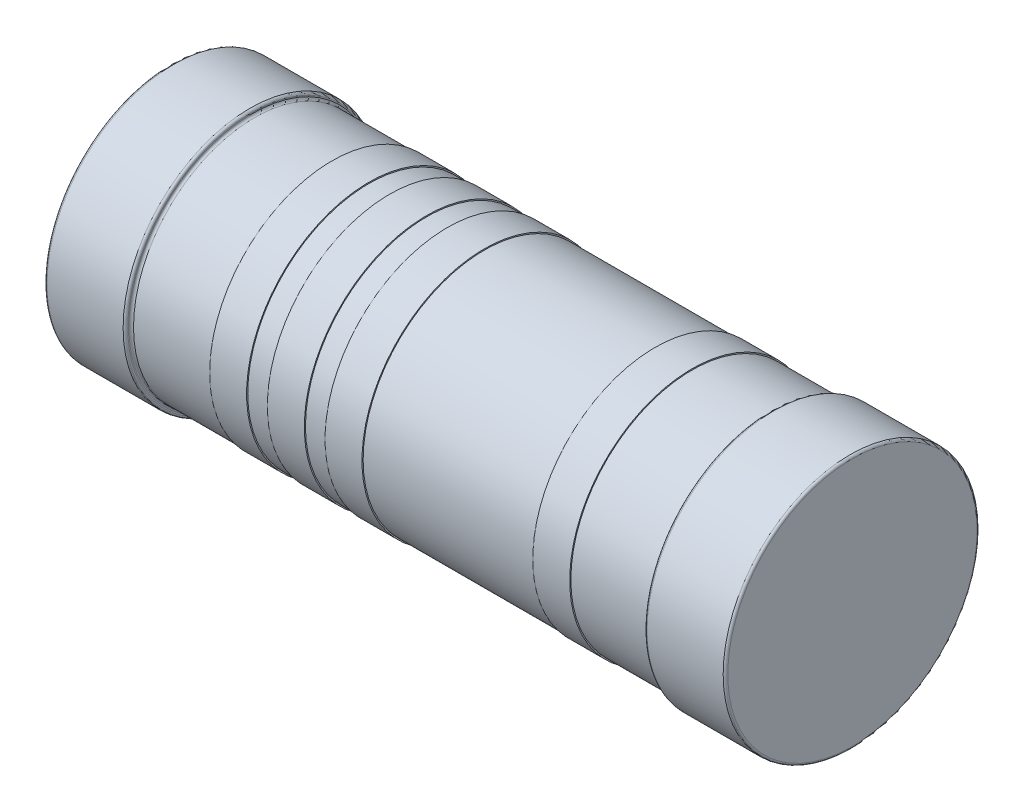
ISO-10303-21;
HEADER;
FILE_DESCRIPTION(('STEP AP214'),'2;1');
FILE_NAME('part.step','',(''),(''),'','','');
FILE_SCHEMA(('AUTOMOTIVE_DESIGN { 1 0 10303 214 1 1 1 1 }'));
ENDSEC;
DATA;
#1=APPLICATION_CONTEXT('core data for automotive mechanical design processes');
#2=APPLICATION_PROTOCOL_DEFINITION('international standard','automotive_design',2000,#1);
#3=PRODUCT_CONTEXT('',#1,'mechanical');
#4=PRODUCT('Part','Part','',(#3));
#5=PRODUCT_RELATED_PRODUCT_CATEGORY('part','',(#4));
#6=PRODUCT_DEFINITION_FORMATION('','',#4);
#7=PRODUCT_DEFINITION_CONTEXT('part definition',#1,'design');
#8=PRODUCT_DEFINITION('design','',#6,#7);
#9=PRODUCT_DEFINITION_SHAPE('','',#8);
#10=(LENGTH_UNIT() NAMED_UNIT(*) SI_UNIT(.MILLI.,.METRE.));
#11=(NAMED_UNIT(*) PLANE_ANGLE_UNIT() SI_UNIT($,.RADIAN.));
#12=(NAMED_UNIT(*) SI_UNIT($,.STERADIAN.) SOLID_ANGLE_UNIT());
#13=UNCERTAINTY_MEASURE_WITH_UNIT(LENGTH_MEASURE(1.E-05),#10,'distance_accuracy_value','');
#14=(GEOMETRIC_REPRESENTATION_CONTEXT(3) GLOBAL_UNCERTAINTY_ASSIGNED_CONTEXT((#13)) GLOBAL_UNIT_ASSIGNED_CONTEXT((#10,
#11,#12)) REPRESENTATION_CONTEXT('',''));
#15=CARTESIAN_POINT('',(0.,0.,0.));
#16=DIRECTION('',(0.,0.,1.));
#17=DIRECTION('',(1.,0.,0.));
#18=AXIS2_PLACEMENT_3D('',#15,#16,#17);
#19=CARTESIAN_POINT('',(-2.95,0.0200000000000001,0.));
#20=DIRECTION('',(1.,0.,0.));
#21=DIRECTION('',(0.,0.,-1.));
#22=AXIS2_PLACEMENT_3D('',#19,#20,#21);
#23=PLANE('',#22);
#24=CARTESIAN_POINT('',(-2.95,1.1,0.));
#25=DIRECTION('',(1.,0.,0.));
#26=DIRECTION('',(0.,0.,-1.));
#27=AXIS2_PLACEMENT_3D('',#24,#25,#26);
#28=CIRCLE('',#27,1.08);
#29=CARTESIAN_POINT('',(-2.95,1.1,-1.08));
#30=VERTEX_POINT('',#29);
#31=EDGE_CURVE('E121',#30,#30,#28,.T.);
#32=ORIENTED_EDGE('',*,*,#31,.F.);
#33=EDGE_LOOP('',(#32));
#34=FACE_BOUND('',#33,.T.);
#35=ADVANCED_FACE('F33',(#34),#23,.F.);
#36=CARTESIAN_POINT('',(2.95,1.1,0.));
#37=DIRECTION('',(-1.,0.,0.));
#38=DIRECTION('',(0.,0.,1.));
#39=AXIS2_PLACEMENT_3D('',#36,#37,#38);
#40=PLANE('',#39);
#41=CARTESIAN_POINT('',(2.95,1.1,0.));
#42=DIRECTION('',(1.,0.,0.));
#43=DIRECTION('',(0.,0.,-1.));
#44=AXIS2_PLACEMENT_3D('',#41,#42,#43);
#45=CIRCLE('',#44,1.08);
#46=CARTESIAN_POINT('',(2.95,1.1,-1.08));
#47=VERTEX_POINT('',#46);
#48=EDGE_CURVE('E10',#47,#47,#45,.T.);
#49=ORIENTED_EDGE('',*,*,#48,.T.);
#50=EDGE_LOOP('',(#49));
#51=FACE_BOUND('',#50,.T.);
#52=ADVANCED_FACE('F128',(#51),#40,.F.);
#53=CARTESIAN_POINT('',(2.93,1.1,0.));
#54=DIRECTION('',(1.,0.,0.));
#55=DIRECTION('',(0.,0.,-1.));
#56=AXIS2_PLACEMENT_3D('',#53,#54,#55);
#57=TOROIDAL_SURFACE('',#56,1.08,0.0200000000000003);
#58=ORIENTED_EDGE('',*,*,#48,.F.);
#59=EDGE_LOOP('',(#58));
#60=FACE_BOUND('',#59,.T.);
#61=CARTESIAN_POINT('',(2.93,1.1,0.));
#62=DIRECTION('',(1.,0.,0.));
#63=DIRECTION('',(0.,0.,-1.));
#64=AXIS2_PLACEMENT_3D('',#61,#62,#63);
#65=CIRCLE('',#64,1.1);
#66=CARTESIAN_POINT('',(2.93,1.1,-1.1));
#67=VERTEX_POINT('',#66);
#68=EDGE_CURVE('E39',#67,#67,#65,.T.);
#69=ORIENTED_EDGE('',*,*,#68,.T.);
#70=EDGE_LOOP('',(#69));
#71=FACE_BOUND('',#70,.T.);
#72=ADVANCED_FACE('F132',(#60,#71),#57,.T.);
#73=CARTESIAN_POINT('',(-2.95,1.1,0.));
#74=DIRECTION('',(1.,0.,0.));
#75=DIRECTION('',(0.,0.,-1.));
#76=AXIS2_PLACEMENT_3D('',#73,#74,#75);
#77=CYLINDRICAL_SURFACE('',#76,1.1);
#78=ORIENTED_EDGE('',*,*,#68,.F.);
#79=EDGE_LOOP('',(#78));
#80=FACE_BOUND('',#79,.T.);
#81=CARTESIAN_POINT('',(2.27,1.1,0.));
#82=DIRECTION('',(1.,0.,0.));
#83=DIRECTION('',(0.,0.,-1.));
#84=AXIS2_PLACEMENT_3D('',#81,#82,#83);
#85=CIRCLE('',#84,1.1);
#86=CARTESIAN_POINT('',(2.27,1.1,-1.1));
#87=VERTEX_POINT('',#86);
#88=EDGE_CURVE('E43',#87,#87,#85,.T.);
#89=ORIENTED_EDGE('',*,*,#88,.T.);
#90=EDGE_LOOP('',(#89));
#91=FACE_BOUND('',#90,.T.);
#92=ADVANCED_FACE('F136',(#80,#91),#77,.T.);
#93=CARTESIAN_POINT('',(2.27,1.1,0.));
#94=DIRECTION('',(1.,0.,0.));
#95=DIRECTION('',(0.,0.,-1.));
#96=AXIS2_PLACEMENT_3D('',#93,#94,#95);
#97=TOROIDAL_SURFACE('',#96,1.08,0.02);
#98=ORIENTED_EDGE('',*,*,#88,.F.);
#99=EDGE_LOOP('',(#98));
#100=FACE_BOUND('',#99,.T.);
#101=CARTESIAN_POINT('',(2.25,1.1,0.));
#102=DIRECTION('',(1.,0.,0.));
#103=DIRECTION('',(0.,0.,-1.));
#104=AXIS2_PLACEMENT_3D('',#101,#102,#103);
#105=CIRCLE('',#104,1.08);
#106=CARTESIAN_POINT('',(2.25,1.1,-1.08));
#107=VERTEX_POINT('',#106);
#108=EDGE_CURVE('E47',#107,#107,#105,.T.);
#109=ORIENTED_EDGE('',*,*,#108,.T.);
#110=EDGE_LOOP('',(#109));
#111=FACE_BOUND('',#110,.T.);
#112=ADVANCED_FACE('F142',(#100,#111),#97,.T.);
#113=CARTESIAN_POINT('',(2.25,0.03,0.));
#114=DIRECTION('',(1.,0.,0.));
#115=DIRECTION('',(0.,0.,-1.));
#116=AXIS2_PLACEMENT_3D('',#113,#114,#115);
#117=PLANE('',#116);
#118=ORIENTED_EDGE('',*,*,#108,.F.);
#119=EDGE_LOOP('',(#118));
#120=FACE_BOUND('',#119,.T.);
#121=CARTESIAN_POINT('',(2.25,1.1,0.));
#122=DIRECTION('',(1.,0.,0.));
#123=DIRECTION('',(0.,0.,-1.));
#124=AXIS2_PLACEMENT_3D('',#121,#122,#123);
#125=CIRCLE('',#124,1.07);
#126=CARTESIAN_POINT('',(2.25,1.1,-1.07));
#127=VERTEX_POINT('',#126);
#128=EDGE_CURVE('E52',#127,#127,#125,.T.);
#129=ORIENTED_EDGE('',*,*,#128,.T.);
#130=EDGE_LOOP('',(#129));
#131=FACE_BOUND('',#130,.T.);
#132=ADVANCED_FACE('F146',(#120,#131),#117,.F.);
#133=CARTESIAN_POINT('',(2.23,1.1,0.));
#134=DIRECTION('',(1.,0.,0.));
#135=DIRECTION('',(0.,0.,-1.));
#136=AXIS2_PLACEMENT_3D('',#133,#134,#135);
#137=TOROIDAL_SURFACE('',#136,1.07,0.02);
#138=ORIENTED_EDGE('',*,*,#128,.F.);
#139=EDGE_LOOP('',(#138));
#140=FACE_BOUND('',#139,.T.);
#141=CARTESIAN_POINT('',(2.23,1.1,0.));
#142=DIRECTION('',(1.,0.,0.));
#143=DIRECTION('',(0.,0.,-1.));
#144=AXIS2_PLACEMENT_3D('',#141,#142,#143);
#145=CIRCLE('',#144,1.05);
#146=CARTESIAN_POINT('',(2.23,1.1,-1.05));
#147=VERTEX_POINT('',#146);
#148=EDGE_CURVE('E55',#147,#147,#145,.T.);
#149=ORIENTED_EDGE('',*,*,#148,.T.);
#150=EDGE_LOOP('',(#149));
#151=FACE_BOUND('',#150,.T.);
#152=ADVANCED_FACE('F150',(#140,#151),#137,.F.);
#153=CARTESIAN_POINT('',(-2.95,1.1,0.));
#154=DIRECTION('',(1.,0.,0.));
#155=DIRECTION('',(0.,0.,-1.));
#156=AXIS2_PLACEMENT_3D('',#153,#154,#155);
#157=CYLINDRICAL_SURFACE('',#156,1.05);
#158=ORIENTED_EDGE('',*,*,#148,.F.);
#159=EDGE_LOOP('',(#158));
#160=FACE_BOUND('',#159,.T.);
#161=CARTESIAN_POINT('',(1.56,1.1,0.));
#162=DIRECTION('',(1.,0.,0.));
#163=DIRECTION('',(0.,0.,-1.));
#164=AXIS2_PLACEMENT_3D('',#161,#162,#163);
#165=CIRCLE('',#164,1.05);
#166=CARTESIAN_POINT('',(1.56,1.1,-1.05));
#167=VERTEX_POINT('',#166);
#168=EDGE_CURVE('E58',#167,#167,#165,.T.);
#169=ORIENTED_EDGE('',*,*,#168,.T.);
#170=EDGE_LOOP('',(#169));
#171=FACE_BOUND('',#170,.T.);
#172=ADVANCED_FACE('F154',(#160,#171),#157,.T.);
#173=CARTESIAN_POINT('',(1.56,0.05,0.));
#174=DIRECTION('',(-1.,0.,0.));
#175=DIRECTION('',(0.,0.,1.));
#176=AXIS2_PLACEMENT_3D('',#173,#174,#175);
#177=PLANE('',#176);
#178=ORIENTED_EDGE('',*,*,#168,.F.);
#179=EDGE_LOOP('',(#178));
#180=FACE_BOUND('',#179,.T.);
#181=CARTESIAN_POINT('',(1.56,1.1,0.));
#182=DIRECTION('',(1.,0.,0.));
#183=DIRECTION('',(0.,0.,-1.));
#184=AXIS2_PLACEMENT_3D('',#181,#182,#183);
#185=CIRCLE('',#184,1.06);
#186=CARTESIAN_POINT('',(1.56,1.1,-1.06));
#187=VERTEX_POINT('',#186);
#188=EDGE_CURVE('E61',#187,#187,#185,.T.);
#189=ORIENTED_EDGE('',*,*,#188,.T.);
#190=EDGE_LOOP('',(#189));
#191=FACE_BOUND('',#190,.T.);
#192=ADVANCED_FACE('F158',(#180,#191),#177,.F.);
#193=CARTESIAN_POINT('',(-2.95,1.1,0.));
#194=DIRECTION('',(1.,0.,0.));
#195=DIRECTION('',(0.,0.,-1.));
#196=AXIS2_PLACEMENT_3D('',#193,#194,#195);
#197=CYLINDRICAL_SURFACE('',#196,1.06);
#198=ORIENTED_EDGE('',*,*,#188,.F.);
#199=EDGE_LOOP('',(#198));
#200=FACE_BOUND('',#199,.T.);
#201=CARTESIAN_POINT('',(1.24,1.1,0.));
#202=DIRECTION('',(1.,0.,0.));
#203=DIRECTION('',(0.,0.,-1.));
#204=AXIS2_PLACEMENT_3D('',#201,#202,#203);
#205=CIRCLE('',#204,1.06);
#206=CARTESIAN_POINT('',(1.24,1.1,-1.06));
#207=VERTEX_POINT('',#206);
#208=EDGE_CURVE('E64',#207,#207,#205,.T.);
#209=ORIENTED_EDGE('',*,*,#208,.T.);
#210=EDGE_LOOP('',(#209));
#211=FACE_BOUND('',#210,.T.);
#212=ADVANCED_FACE('F162',(#200,#211),#197,.T.);
#213=CARTESIAN_POINT('',(1.24,0.0400000000000002,0.));
#214=DIRECTION('',(1.,0.,0.));
#215=DIRECTION('',(0.,0.,-1.));
#216=AXIS2_PLACEMENT_3D('',#213,#214,#215);
#217=PLANE('',#216);
#218=ORIENTED_EDGE('',*,*,#208,.F.);
#219=EDGE_LOOP('',(#218));
#220=FACE_BOUND('',#219,.T.);
#221=CARTESIAN_POINT('',(1.24,1.1,0.));
#222=DIRECTION('',(1.,0.,0.));
#223=DIRECTION('',(0.,0.,-1.));
#224=AXIS2_PLACEMENT_3D('',#221,#222,#223);
#225=CIRCLE('',#224,1.05);
#226=CARTESIAN_POINT('',(1.24,1.1,-1.05));
#227=VERTEX_POINT('',#226);
#228=EDGE_CURVE('E67',#227,#227,#225,.T.);
#229=ORIENTED_EDGE('',*,*,#228,.T.);
#230=EDGE_LOOP('',(#229));
#231=FACE_BOUND('',#230,.T.);
#232=ADVANCED_FACE('F166',(#220,#231),#217,.F.);
#233=CARTESIAN_POINT('',(-2.95,1.1,0.));
#234=DIRECTION('',(1.,0.,0.));
#235=DIRECTION('',(0.,0.,-1.));
#236=AXIS2_PLACEMENT_3D('',#233,#234,#235);
#237=CYLINDRICAL_SURFACE('',#236,1.05);
#238=ORIENTED_EDGE('',*,*,#228,.F.);
#239=EDGE_LOOP('',(#238));
#240=FACE_BOUND('',#239,.T.);
#241=CARTESIAN_POINT('',(-0.24,1.1,0.));
#242=DIRECTION('',(1.,0.,0.));
#243=DIRECTION('',(0.,0.,-1.));
#244=AXIS2_PLACEMENT_3D('',#241,#242,#243);
#245=CIRCLE('',#244,1.05);
#246=CARTESIAN_POINT('',(-0.24,1.1,-1.05));
#247=VERTEX_POINT('',#246);
#248=EDGE_CURVE('E70',#247,#247,#245,.T.);
#249=ORIENTED_EDGE('',*,*,#248,.T.);
#250=EDGE_LOOP('',(#249));
#251=FACE_BOUND('',#250,.T.);
#252=ADVANCED_FACE('F170',(#240,#251),#237,.T.);
#253=CARTESIAN_POINT('',(-0.24,0.04,0.));
#254=DIRECTION('',(-1.,0.,0.));
#255=DIRECTION('',(0.,0.,1.));
#256=AXIS2_PLACEMENT_3D('',#253,#254,#255);
#257=PLANE('',#256);
#258=ORIENTED_EDGE('',*,*,#248,.F.);
#259=EDGE_LOOP('',(#258));
#260=FACE_BOUND('',#259,.T.);
#261=CARTESIAN_POINT('',(-0.24,1.1,0.));
#262=DIRECTION('',(1.,0.,0.));
#263=DIRECTION('',(0.,0.,-1.));
#264=AXIS2_PLACEMENT_3D('',#261,#262,#263);
#265=CIRCLE('',#264,1.06);
#266=CARTESIAN_POINT('',(-0.24,1.1,-1.06));
#267=VERTEX_POINT('',#266);
#268=EDGE_CURVE('E73',#267,#267,#265,.T.);
#269=ORIENTED_EDGE('',*,*,#268,.T.);
#270=EDGE_LOOP('',(#269));
#271=FACE_BOUND('',#270,.T.);
#272=ADVANCED_FACE('F174',(#260,#271),#257,.F.);
#273=CARTESIAN_POINT('',(-2.95,1.1,0.));
#274=DIRECTION('',(1.,0.,0.));
#275=DIRECTION('',(0.,0.,-1.));
#276=AXIS2_PLACEMENT_3D('',#273,#274,#275);
#277=CYLINDRICAL_SURFACE('',#276,1.06);
#278=ORIENTED_EDGE('',*,*,#268,.F.);
#279=EDGE_LOOP('',(#278));
#280=FACE_BOUND('',#279,.T.);
#281=CARTESIAN_POINT('',(-0.56,1.1,0.));
#282=DIRECTION('',(1.,0.,0.));
#283=DIRECTION('',(0.,0.,-1.));
#284=AXIS2_PLACEMENT_3D('',#281,#282,#283);
#285=CIRCLE('',#284,1.06);
#286=CARTESIAN_POINT('',(-0.56,1.1,-1.06));
#287=VERTEX_POINT('',#286);
#288=EDGE_CURVE('E76',#287,#287,#285,.T.);
#289=ORIENTED_EDGE('',*,*,#288,.T.);
#290=EDGE_LOOP('',(#289));
#291=FACE_BOUND('',#290,.T.);
#292=ADVANCED_FACE('F178',(#280,#291),#277,.T.);
#293=CARTESIAN_POINT('',(-0.56,0.04,0.));
#294=DIRECTION('',(1.,0.,0.));
#295=DIRECTION('',(0.,0.,-1.));
#296=AXIS2_PLACEMENT_3D('',#293,#294,#295);
#297=PLANE('',#296);
#298=ORIENTED_EDGE('',*,*,#288,.F.);
#299=EDGE_LOOP('',(#298));
#300=FACE_BOUND('',#299,.T.);
#301=CARTESIAN_POINT('',(-0.56,1.1,0.));
#302=DIRECTION('',(1.,0.,0.));
#303=DIRECTION('',(0.,0.,-1.));
#304=AXIS2_PLACEMENT_3D('',#301,#302,#303);
#305=CIRCLE('',#304,1.05);
#306=CARTESIAN_POINT('',(-0.56,1.1,-1.05));
#307=VERTEX_POINT('',#306);
#308=EDGE_CURVE('E79',#307,#307,#305,.T.);
#309=ORIENTED_EDGE('',*,*,#308,.T.);
#310=EDGE_LOOP('',(#309));
#311=FACE_BOUND('',#310,.T.);
#312=ADVANCED_FACE('F182',(#300,#311),#297,.F.);
#313=CARTESIAN_POINT('',(-2.95,1.1,0.));
#314=DIRECTION('',(1.,0.,0.));
#315=DIRECTION('',(0.,0.,-1.));
#316=AXIS2_PLACEMENT_3D('',#313,#314,#315);
#317=CYLINDRICAL_SURFACE('',#316,1.05);
#318=ORIENTED_EDGE('',*,*,#308,.F.);
#319=EDGE_LOOP('',(#318));
#320=FACE_BOUND('',#319,.T.);
#321=CARTESIAN_POINT('',(-0.74,1.1,0.));
#322=DIRECTION('',(1.,0.,0.));
#323=DIRECTION('',(0.,0.,-1.));
#324=AXIS2_PLACEMENT_3D('',#321,#322,#323);
#325=CIRCLE('',#324,1.05);
#326=CARTESIAN_POINT('',(-0.74,1.1,-1.05));
#327=VERTEX_POINT('',#326);
#328=EDGE_CURVE('E82',#327,#327,#325,.T.);
#329=ORIENTED_EDGE('',*,*,#328,.T.);
#330=EDGE_LOOP('',(#329));
#331=FACE_BOUND('',#330,.T.);
#332=ADVANCED_FACE('F186',(#320,#331),#317,.T.);
#333=CARTESIAN_POINT('',(-0.74,0.04,0.));
#334=DIRECTION('',(-1.,0.,0.));
#335=DIRECTION('',(0.,0.,1.));
#336=AXIS2_PLACEMENT_3D('',#333,#334,#335);
#337=PLANE('',#336);
#338=ORIENTED_EDGE('',*,*,#328,.F.);
#339=EDGE_LOOP('',(#338));
#340=FACE_BOUND('',#339,.T.);
#341=CARTESIAN_POINT('',(-0.74,1.1,0.));
#342=DIRECTION('',(1.,0.,0.));
#343=DIRECTION('',(0.,0.,-1.));
#344=AXIS2_PLACEMENT_3D('',#341,#342,#343);
#345=CIRCLE('',#344,1.06);
#346=CARTESIAN_POINT('',(-0.74,1.1,-1.06));
#347=VERTEX_POINT('',#346);
#348=EDGE_CURVE('E85',#347,#347,#345,.T.);
#349=ORIENTED_EDGE('',*,*,#348,.T.);
#350=EDGE_LOOP('',(#349));
#351=FACE_BOUND('',#350,.T.);
#352=ADVANCED_FACE('F190',(#340,#351),#337,.F.);
#353=CARTESIAN_POINT('',(-2.95,1.1,0.));
#354=DIRECTION('',(1.,0.,0.));
#355=DIRECTION('',(0.,0.,-1.));
#356=AXIS2_PLACEMENT_3D('',#353,#354,#355);
#357=CYLINDRICAL_SURFACE('',#356,1.06);
#358=ORIENTED_EDGE('',*,*,#348,.F.);
#359=EDGE_LOOP('',(#358));
#360=FACE_BOUND('',#359,.T.);
#361=CARTESIAN_POINT('',(-1.06,1.1,0.));
#362=DIRECTION('',(1.,0.,0.));
#363=DIRECTION('',(0.,0.,-1.));
#364=AXIS2_PLACEMENT_3D('',#361,#362,#363);
#365=CIRCLE('',#364,1.06);
#366=CARTESIAN_POINT('',(-1.06,1.1,-1.06));
#367=VERTEX_POINT('',#366);
#368=EDGE_CURVE('E88',#367,#367,#365,.T.);
#369=ORIENTED_EDGE('',*,*,#368,.T.);
#370=EDGE_LOOP('',(#369));
#371=FACE_BOUND('',#370,.T.);
#372=ADVANCED_FACE('F194',(#360,#371),#357,.T.);
#373=CARTESIAN_POINT('',(-1.06,0.05,0.));
#374=DIRECTION('',(1.,0.,0.));
#375=DIRECTION('',(0.,0.,-1.));
#376=AXIS2_PLACEMENT_3D('',#373,#374,#375);
#377=PLANE('',#376);
#378=ORIENTED_EDGE('',*,*,#368,.F.);
#379=EDGE_LOOP('',(#378));
#380=FACE_BOUND('',#379,.T.);
#381=CARTESIAN_POINT('',(-1.06,1.1,0.));
#382=DIRECTION('',(1.,0.,0.));
#383=DIRECTION('',(0.,0.,-1.));
#384=AXIS2_PLACEMENT_3D('',#381,#382,#383);
#385=CIRCLE('',#384,1.05);
#386=CARTESIAN_POINT('',(-1.06,1.1,-1.05));
#387=VERTEX_POINT('',#386);
#388=EDGE_CURVE('E91',#387,#387,#385,.T.);
#389=ORIENTED_EDGE('',*,*,#388,.T.);
#390=EDGE_LOOP('',(#389));
#391=FACE_BOUND('',#390,.T.);
#392=ADVANCED_FACE('F198',(#380,#391),#377,.F.);
#393=CARTESIAN_POINT('',(-2.95,1.1,0.));
#394=DIRECTION('',(1.,0.,0.));
#395=DIRECTION('',(0.,0.,-1.));
#396=AXIS2_PLACEMENT_3D('',#393,#394,#395);
#397=CYLINDRICAL_SURFACE('',#396,1.05);
#398=ORIENTED_EDGE('',*,*,#388,.F.);
#399=EDGE_LOOP('',(#398));
#400=FACE_BOUND('',#399,.T.);
#401=CARTESIAN_POINT('',(-1.24,1.1,0.));
#402=DIRECTION('',(1.,0.,0.));
#403=DIRECTION('',(0.,0.,-1.));
#404=AXIS2_PLACEMENT_3D('',#401,#402,#403);
#405=CIRCLE('',#404,1.05);
#406=CARTESIAN_POINT('',(-1.24,1.1,-1.05));
#407=VERTEX_POINT('',#406);
#408=EDGE_CURVE('E94',#407,#407,#405,.T.);
#409=ORIENTED_EDGE('',*,*,#408,.T.);
#410=EDGE_LOOP('',(#409));
#411=FACE_BOUND('',#410,.T.);
#412=ADVANCED_FACE('F202',(#400,#411),#397,.T.);
#413=CARTESIAN_POINT('',(-1.24,0.04,0.));
#414=DIRECTION('',(-1.,0.,0.));
#415=DIRECTION('',(0.,0.,1.));
#416=AXIS2_PLACEMENT_3D('',#413,#414,#415);
#417=PLANE('',#416);
#418=ORIENTED_EDGE('',*,*,#408,.F.);
#419=EDGE_LOOP('',(#418));
#420=FACE_BOUND('',#419,.T.);
#421=CARTESIAN_POINT('',(-1.24,1.1,0.));
#422=DIRECTION('',(1.,0.,0.));
#423=DIRECTION('',(0.,0.,-1.));
#424=AXIS2_PLACEMENT_3D('',#421,#422,#423);
#425=CIRCLE('',#424,1.06);
#426=CARTESIAN_POINT('',(-1.24,1.1,-1.06));
#427=VERTEX_POINT('',#426);
#428=EDGE_CURVE('E97',#427,#427,#425,.T.);
#429=ORIENTED_EDGE('',*,*,#428,.T.);
#430=EDGE_LOOP('',(#429));
#431=FACE_BOUND('',#430,.T.);
#432=ADVANCED_FACE('F206',(#420,#431),#417,.F.);
#433=CARTESIAN_POINT('',(-2.95,1.1,0.));
#434=DIRECTION('',(1.,0.,0.));
#435=DIRECTION('',(0.,0.,-1.));
#436=AXIS2_PLACEMENT_3D('',#433,#434,#435);
#437=CYLINDRICAL_SURFACE('',#436,1.06);
#438=ORIENTED_EDGE('',*,*,#428,.F.);
#439=EDGE_LOOP('',(#438));
#440=FACE_BOUND('',#439,.T.);
#441=CARTESIAN_POINT('',(-1.56,1.1,0.));
#442=DIRECTION('',(1.,0.,0.));
#443=DIRECTION('',(0.,0.,-1.));
#444=AXIS2_PLACEMENT_3D('',#441,#442,#443);
#445=CIRCLE('',#444,1.06);
#446=CARTESIAN_POINT('',(-1.56,1.1,-1.06));
#447=VERTEX_POINT('',#446);
#448=EDGE_CURVE('E100',#447,#447,#445,.T.);
#449=ORIENTED_EDGE('',*,*,#448,.T.);
#450=EDGE_LOOP('',(#449));
#451=FACE_BOUND('',#450,.T.);
#452=ADVANCED_FACE('F210',(#440,#451),#437,.T.);
#453=CARTESIAN_POINT('',(-1.56,0.05,0.));
#454=DIRECTION('',(1.,0.,0.));
#455=DIRECTION('',(0.,0.,-1.));
#456=AXIS2_PLACEMENT_3D('',#453,#454,#455);
#457=PLANE('',#456);
#458=ORIENTED_EDGE('',*,*,#448,.F.);
#459=EDGE_LOOP('',(#458));
#460=FACE_BOUND('',#459,.T.);
#461=CARTESIAN_POINT('',(-1.56,1.1,0.));
#462=DIRECTION('',(1.,0.,0.));
#463=DIRECTION('',(0.,0.,-1.));
#464=AXIS2_PLACEMENT_3D('',#461,#462,#463);
#465=CIRCLE('',#464,1.05);
#466=CARTESIAN_POINT('',(-1.56,1.1,-1.05));
#467=VERTEX_POINT('',#466);
#468=EDGE_CURVE('E103',#467,#467,#465,.T.);
#469=ORIENTED_EDGE('',*,*,#468,.T.);
#470=EDGE_LOOP('',(#469));
#471=FACE_BOUND('',#470,.T.);
#472=ADVANCED_FACE('F214',(#460,#471),#457,.F.);
#473=CARTESIAN_POINT('',(-2.95,1.1,0.));
#474=DIRECTION('',(1.,0.,0.));
#475=DIRECTION('',(0.,0.,-1.));
#476=AXIS2_PLACEMENT_3D('',#473,#474,#475);
#477=CYLINDRICAL_SURFACE('',#476,1.05);
#478=ORIENTED_EDGE('',*,*,#468,.F.);
#479=EDGE_LOOP('',(#478));
#480=FACE_BOUND('',#479,.T.);
#481=CARTESIAN_POINT('',(-2.23,1.1,0.));
#482=DIRECTION('',(1.,0.,0.));
#483=DIRECTION('',(0.,0.,-1.));
#484=AXIS2_PLACEMENT_3D('',#481,#482,#483);
#485=CIRCLE('',#484,1.05);
#486=CARTESIAN_POINT('',(-2.23,1.1,-1.05));
#487=VERTEX_POINT('',#486);
#488=EDGE_CURVE('E106',#487,#487,#485,.T.);
#489=ORIENTED_EDGE('',*,*,#488,.T.);
#490=EDGE_LOOP('',(#489));
#491=FACE_BOUND('',#490,.T.);
#492=ADVANCED_FACE('F218',(#480,#491),#477,.T.);
#493=CARTESIAN_POINT('',(-2.23,1.1,0.));
#494=DIRECTION('',(1.,0.,0.));
#495=DIRECTION('',(0.,0.,-1.));
#496=AXIS2_PLACEMENT_3D('',#493,#494,#495);
#497=TOROIDAL_SURFACE('',#496,1.07,0.02);
#498=ORIENTED_EDGE('',*,*,#488,.F.);
#499=EDGE_LOOP('',(#498));
#500=FACE_BOUND('',#499,.T.);
#501=CARTESIAN_POINT('',(-2.25,1.1,0.));
#502=DIRECTION('',(1.,0.,0.));
#503=DIRECTION('',(0.,0.,-1.));
#504=AXIS2_PLACEMENT_3D('',#501,#502,#503);
#505=CIRCLE('',#504,1.07);
#506=CARTESIAN_POINT('',(-2.25,1.1,-1.07));
#507=VERTEX_POINT('',#506);
#508=EDGE_CURVE('E109',#507,#507,#505,.T.);
#509=ORIENTED_EDGE('',*,*,#508,.T.);
#510=EDGE_LOOP('',(#509));
#511=FACE_BOUND('',#510,.T.);
#512=ADVANCED_FACE('F222',(#500,#511),#497,.F.);
#513=CARTESIAN_POINT('',(-2.25,0.02,0.));
#514=DIRECTION('',(-1.,0.,0.));
#515=DIRECTION('',(0.,0.,1.));
#516=AXIS2_PLACEMENT_3D('',#513,#514,#515);
#517=PLANE('',#516);
#518=ORIENTED_EDGE('',*,*,#508,.F.);
#519=EDGE_LOOP('',(#518));
#520=FACE_BOUND('',#519,.T.);
#521=CARTESIAN_POINT('',(-2.25,1.1,0.));
#522=DIRECTION('',(1.,0.,0.));
#523=DIRECTION('',(0.,0.,-1.));
#524=AXIS2_PLACEMENT_3D('',#521,#522,#523);
#525=CIRCLE('',#524,1.08);
#526=CARTESIAN_POINT('',(-2.25,1.1,-1.08));
#527=VERTEX_POINT('',#526);
#528=EDGE_CURVE('E112',#527,#527,#525,.T.);
#529=ORIENTED_EDGE('',*,*,#528,.T.);
#530=EDGE_LOOP('',(#529));
#531=FACE_BOUND('',#530,.T.);
#532=ADVANCED_FACE('F226',(#520,#531),#517,.F.);
#533=CARTESIAN_POINT('',(-2.27,1.1,0.));
#534=DIRECTION('',(1.,0.,0.));
#535=DIRECTION('',(0.,0.,-1.));
#536=AXIS2_PLACEMENT_3D('',#533,#534,#535);
#537=TOROIDAL_SURFACE('',#536,1.08,0.02);
#538=ORIENTED_EDGE('',*,*,#528,.F.);
#539=EDGE_LOOP('',(#538));
#540=FACE_BOUND('',#539,.T.);
#541=CARTESIAN_POINT('',(-2.27,1.1,0.));
#542=DIRECTION('',(1.,0.,0.));
#543=DIRECTION('',(0.,0.,-1.));
#544=AXIS2_PLACEMENT_3D('',#541,#542,#543);
#545=CIRCLE('',#544,1.1);
#546=CARTESIAN_POINT('',(-2.27,1.1,-1.1));
#547=VERTEX_POINT('',#546);
#548=EDGE_CURVE('E115',#547,#547,#545,.T.);
#549=ORIENTED_EDGE('',*,*,#548,.T.);
#550=EDGE_LOOP('',(#549));
#551=FACE_BOUND('',#550,.T.);
#552=ADVANCED_FACE('F230',(#540,#551),#537,.T.);
#553=CARTESIAN_POINT('',(-2.95,1.1,0.));
#554=DIRECTION('',(1.,0.,0.));
#555=DIRECTION('',(0.,0.,-1.));
#556=AXIS2_PLACEMENT_3D('',#553,#554,#555);
#557=CYLINDRICAL_SURFACE('',#556,1.1);
#558=ORIENTED_EDGE('',*,*,#548,.F.);
#559=EDGE_LOOP('',(#558));
#560=FACE_BOUND('',#559,.T.);
#561=CARTESIAN_POINT('',(-2.93,1.1,0.));
#562=DIRECTION('',(1.,0.,0.));
#563=DIRECTION('',(0.,0.,-1.));
#564=AXIS2_PLACEMENT_3D('',#561,#562,#563);
#565=CIRCLE('',#564,1.1);
#566=CARTESIAN_POINT('',(-2.93,1.1,-1.1));
#567=VERTEX_POINT('',#566);
#568=EDGE_CURVE('E118',#567,#567,#565,.T.);
#569=ORIENTED_EDGE('',*,*,#568,.T.);
#570=EDGE_LOOP('',(#569));
#571=FACE_BOUND('',#570,.T.);
#572=ADVANCED_FACE('F234',(#560,#571),#557,.T.);
#573=CARTESIAN_POINT('',(-2.93,1.1,0.));
#574=DIRECTION('',(1.,0.,0.));
#575=DIRECTION('',(0.,0.,-1.));
#576=AXIS2_PLACEMENT_3D('',#573,#574,#575);
#577=TOROIDAL_SURFACE('',#576,1.08,0.0200000000000003);
#578=ORIENTED_EDGE('',*,*,#568,.F.);
#579=EDGE_LOOP('',(#578));
#580=FACE_BOUND('',#579,.T.);
#581=ORIENTED_EDGE('',*,*,#31,.T.);
#582=EDGE_LOOP('',(#581));
#583=FACE_BOUND('',#582,.T.);
#584=ADVANCED_FACE('F125',(#580,#583),#577,.T.);
#585=CLOSED_SHELL('',(#35,#52,#72,#92,#112,#132,#152,#172,#192,#212,#232,#252,#272,#292,#312,
#332,#352,#372,#392,#412,#432,#452,#472,#492,#512,#532,#552,#572,#584));
#586=MANIFOLD_SOLID_BREP('B2',#585);
#587=ADVANCED_BREP_SHAPE_REPRESENTATION('',(#18,#586),#14);
#588=SHAPE_DEFINITION_REPRESENTATION(#9,#587);
ENDSEC;
END-ISO-10303-21;
